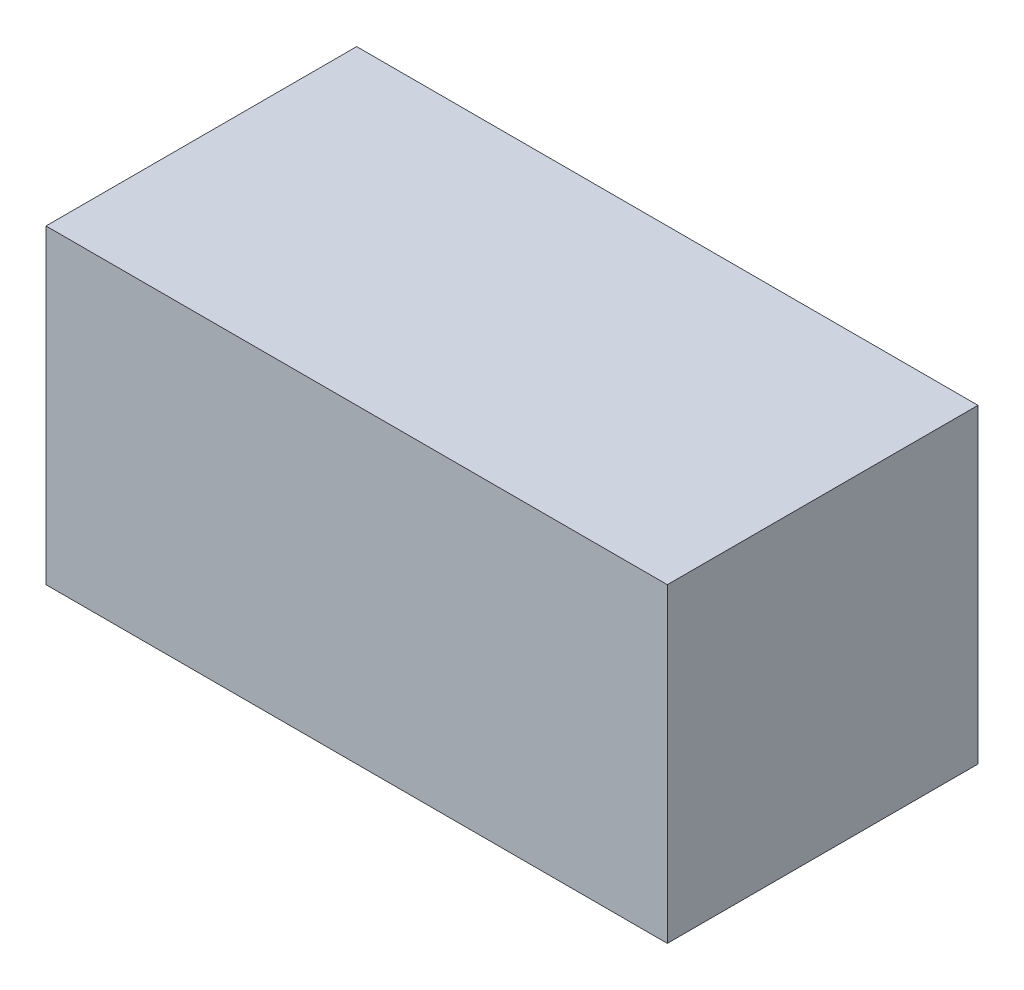
ISO-10303-21;
HEADER;
FILE_DESCRIPTION(('STEP AP214'),'2;1');
FILE_NAME('part.step','',(''),(''),'','','');
FILE_SCHEMA(('AUTOMOTIVE_DESIGN { 1 0 10303 214 1 1 1 1 }'));
ENDSEC;
DATA;
#1=APPLICATION_CONTEXT('core data for automotive mechanical design processes');
#2=APPLICATION_PROTOCOL_DEFINITION('international standard','automotive_design',2000,#1);
#3=PRODUCT_CONTEXT('',#1,'mechanical');
#4=PRODUCT('Part','Part','',(#3));
#5=PRODUCT_RELATED_PRODUCT_CATEGORY('part','',(#4));
#6=PRODUCT_DEFINITION_FORMATION('','',#4);
#7=PRODUCT_DEFINITION_CONTEXT('part definition',#1,'design');
#8=PRODUCT_DEFINITION('design','',#6,#7);
#9=PRODUCT_DEFINITION_SHAPE('','',#8);
#10=(LENGTH_UNIT() NAMED_UNIT(*) SI_UNIT(.MILLI.,.METRE.));
#11=(NAMED_UNIT(*) PLANE_ANGLE_UNIT() SI_UNIT($,.RADIAN.));
#12=(NAMED_UNIT(*) SI_UNIT($,.STERADIAN.) SOLID_ANGLE_UNIT());
#13=UNCERTAINTY_MEASURE_WITH_UNIT(LENGTH_MEASURE(1.E-05),#10,'distance_accuracy_value','');
#14=(GEOMETRIC_REPRESENTATION_CONTEXT(3) GLOBAL_UNCERTAINTY_ASSIGNED_CONTEXT((#13)) GLOBAL_UNIT_ASSIGNED_CONTEXT((#10,
#11,#12)) REPRESENTATION_CONTEXT('',''));
#15=CARTESIAN_POINT('',(0.,0.,0.));
#16=DIRECTION('',(0.,0.,1.));
#17=DIRECTION('',(1.,0.,0.));
#18=AXIS2_PLACEMENT_3D('',#15,#16,#17);
#19=CARTESIAN_POINT('',(150.,150.,-75.));
#20=DIRECTION('',(-1.,0.,0.));
#21=DIRECTION('',(0.,0.,1.));
#22=AXIS2_PLACEMENT_3D('',#19,#20,#21);
#23=PLANE('',#22);
#24=DIRECTION('',(0.,0.,-1.));
#25=VECTOR('',#24,1.);
#26=CARTESIAN_POINT('',(150.,0.,-75.));
#27=LINE('',#26,#25);
#28=CARTESIAN_POINT('',(150.,0.,75.));
#29=VERTEX_POINT('',#28);
#30=CARTESIAN_POINT('',(150.,0.,-75.));
#31=VERTEX_POINT('',#30);
#32=EDGE_CURVE('E98',#29,#31,#27,.T.);
#33=ORIENTED_EDGE('',*,*,#32,.T.);
#34=DIRECTION('',(0.,-1.,0.));
#35=VECTOR('',#34,1.);
#36=CARTESIAN_POINT('',(150.,150.,-75.));
#37=LINE('',#36,#35);
#38=CARTESIAN_POINT('',(150.,150.,-75.));
#39=VERTEX_POINT('',#38);
#40=EDGE_CURVE('E11',#39,#31,#37,.T.);
#41=ORIENTED_EDGE('',*,*,#40,.F.);
#42=DIRECTION('',(0.,0.,-1.));
#43=VECTOR('',#42,1.);
#44=CARTESIAN_POINT('',(150.,150.,-75.));
#45=LINE('',#44,#43);
#46=CARTESIAN_POINT('',(150.,150.,75.));
#47=VERTEX_POINT('',#46);
#48=EDGE_CURVE('E86',#47,#39,#45,.T.);
#49=ORIENTED_EDGE('',*,*,#48,.F.);
#50=DIRECTION('',(0.,-1.,0.));
#51=VECTOR('',#50,1.);
#52=CARTESIAN_POINT('',(150.,150.,75.));
#53=LINE('',#52,#51);
#54=EDGE_CURVE('E94',#47,#29,#53,.T.);
#55=ORIENTED_EDGE('',*,*,#54,.T.);
#56=EDGE_LOOP('',(#33,#41,#49,#55));
#57=FACE_BOUND('',#56,.T.);
#58=ADVANCED_FACE('F35',(#57),#23,.F.);
#59=CARTESIAN_POINT('',(-150.,150.,-75.));
#60=DIRECTION('',(0.,0.,1.));
#61=DIRECTION('',(1.,0.,0.));
#62=AXIS2_PLACEMENT_3D('',#59,#60,#61);
#63=PLANE('',#62);
#64=DIRECTION('',(-1.,0.,0.));
#65=VECTOR('',#64,1.);
#66=CARTESIAN_POINT('',(-150.,0.,-75.));
#67=LINE('',#66,#65);
#68=CARTESIAN_POINT('',(-150.,0.,-75.));
#69=VERTEX_POINT('',#68);
#70=EDGE_CURVE('E90',#31,#69,#67,.T.);
#71=ORIENTED_EDGE('',*,*,#70,.T.);
#72=DIRECTION('',(0.,-1.,0.));
#73=VECTOR('',#72,1.);
#74=CARTESIAN_POINT('',(-150.,150.,-75.));
#75=LINE('',#74,#73);
#76=CARTESIAN_POINT('',(-150.,150.,-75.));
#77=VERTEX_POINT('',#76);
#78=EDGE_CURVE('E43',#77,#69,#75,.T.);
#79=ORIENTED_EDGE('',*,*,#78,.F.);
#80=DIRECTION('',(-1.,0.,0.));
#81=VECTOR('',#80,1.);
#82=CARTESIAN_POINT('',(-150.,150.,-75.));
#83=LINE('',#82,#81);
#84=EDGE_CURVE('E81',#39,#77,#83,.T.);
#85=ORIENTED_EDGE('',*,*,#84,.F.);
#86=ORIENTED_EDGE('',*,*,#40,.T.);
#87=EDGE_LOOP('',(#71,#79,#85,#86));
#88=FACE_BOUND('',#87,.T.);
#89=ADVANCED_FACE('F89',(#88),#63,.F.);
#90=CARTESIAN_POINT('',(-150.,150.,-75.));
#91=DIRECTION('',(1.,0.,0.));
#92=DIRECTION('',(0.,0.,-1.));
#93=AXIS2_PLACEMENT_3D('',#90,#91,#92);
#94=PLANE('',#93);
#95=DIRECTION('',(0.,0.,1.));
#96=VECTOR('',#95,1.);
#97=CARTESIAN_POINT('',(-150.,0.,-75.));
#98=LINE('',#97,#96);
#99=CARTESIAN_POINT('',(-150.,0.,75.));
#100=VERTEX_POINT('',#99);
#101=EDGE_CURVE('E68',#69,#100,#98,.T.);
#102=ORIENTED_EDGE('',*,*,#101,.T.);
#103=DIRECTION('',(0.,-1.,0.));
#104=VECTOR('',#103,1.);
#105=CARTESIAN_POINT('',(-150.,150.,75.));
#106=LINE('',#105,#104);
#107=CARTESIAN_POINT('',(-150.,150.,75.));
#108=VERTEX_POINT('',#107);
#109=EDGE_CURVE('E91',#108,#100,#106,.T.);
#110=ORIENTED_EDGE('',*,*,#109,.F.);
#111=DIRECTION('',(0.,0.,1.));
#112=VECTOR('',#111,1.);
#113=CARTESIAN_POINT('',(-150.,150.,-75.));
#114=LINE('',#113,#112);
#115=EDGE_CURVE('E84',#77,#108,#114,.T.);
#116=ORIENTED_EDGE('',*,*,#115,.F.);
#117=ORIENTED_EDGE('',*,*,#78,.T.);
#118=EDGE_LOOP('',(#102,#110,#116,#117));
#119=FACE_BOUND('',#118,.T.);
#120=ADVANCED_FACE('F92',(#119),#94,.F.);
#121=CARTESIAN_POINT('',(-150.,150.,75.));
#122=DIRECTION('',(0.,0.,-1.));
#123=DIRECTION('',(-1.,0.,0.));
#124=AXIS2_PLACEMENT_3D('',#121,#122,#123);
#125=PLANE('',#124);
#126=DIRECTION('',(1.,0.,0.));
#127=VECTOR('',#126,1.);
#128=CARTESIAN_POINT('',(-150.,0.,75.));
#129=LINE('',#128,#127);
#130=EDGE_CURVE('E74',#100,#29,#129,.T.);
#131=ORIENTED_EDGE('',*,*,#130,.T.);
#132=ORIENTED_EDGE('',*,*,#54,.F.);
#133=DIRECTION('',(1.,0.,0.));
#134=VECTOR('',#133,1.);
#135=CARTESIAN_POINT('',(-150.,150.,75.));
#136=LINE('',#135,#134);
#137=EDGE_CURVE('E51',#108,#47,#136,.T.);
#138=ORIENTED_EDGE('',*,*,#137,.F.);
#139=ORIENTED_EDGE('',*,*,#109,.T.);
#140=EDGE_LOOP('',(#131,#132,#138,#139));
#141=FACE_BOUND('',#140,.T.);
#142=ADVANCED_FACE('F105',(#141),#125,.F.);
#143=CARTESIAN_POINT('',(0.,150.,0.));
#144=DIRECTION('',(0.,1.,0.));
#145=DIRECTION('',(0.,0.,1.));
#146=AXIS2_PLACEMENT_3D('',#143,#144,#145);
#147=PLANE('',#146);
#148=ORIENTED_EDGE('',*,*,#48,.T.);
#149=ORIENTED_EDGE('',*,*,#84,.T.);
#150=ORIENTED_EDGE('',*,*,#115,.T.);
#151=ORIENTED_EDGE('',*,*,#137,.T.);
#152=EDGE_LOOP('',(#148,#149,#150,#151));
#153=FACE_BOUND('',#152,.T.);
#154=ADVANCED_FACE('F82',(#153),#147,.T.);
#155=CARTESIAN_POINT('',(0.,0.,0.));
#156=DIRECTION('',(0.,1.,0.));
#157=DIRECTION('',(0.,0.,1.));
#158=AXIS2_PLACEMENT_3D('',#155,#156,#157);
#159=PLANE('',#158);
#160=ORIENTED_EDGE('',*,*,#32,.F.);
#161=ORIENTED_EDGE('',*,*,#130,.F.);
#162=ORIENTED_EDGE('',*,*,#101,.F.);
#163=ORIENTED_EDGE('',*,*,#70,.F.);
#164=EDGE_LOOP('',(#160,#161,#162,#163));
#165=FACE_BOUND('',#164,.T.);
#166=ADVANCED_FACE('F108',(#165),#159,.F.);
#167=CLOSED_SHELL('',(#58,#89,#120,#142,#154,#166));
#168=MANIFOLD_SOLID_BREP('B2',#167);
#169=ADVANCED_BREP_SHAPE_REPRESENTATION('',(#18,#168),#14);
#170=SHAPE_DEFINITION_REPRESENTATION(#9,#169);
ENDSEC;
END-ISO-10303-21;
